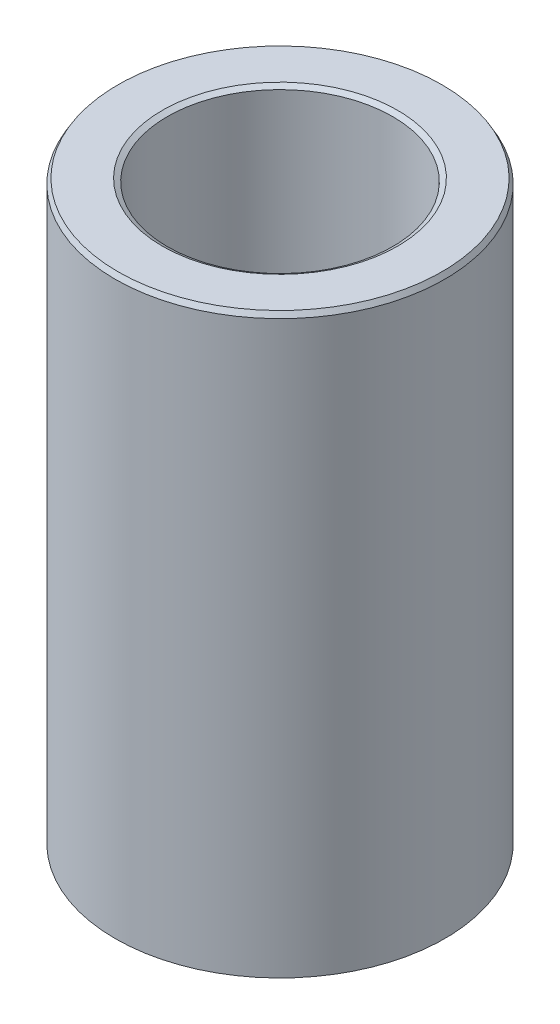
ISO-10303-21;
HEADER;
FILE_DESCRIPTION(('STEP AP214'),'2;1');
FILE_NAME('part.step','',(''),(''),'','','');
FILE_SCHEMA(('AUTOMOTIVE_DESIGN { 1 0 10303 214 1 1 1 1 }'));
ENDSEC;
DATA;
#1=APPLICATION_CONTEXT('core data for automotive mechanical design processes');
#2=APPLICATION_PROTOCOL_DEFINITION('international standard','automotive_design',2000,#1);
#3=PRODUCT_CONTEXT('',#1,'mechanical');
#4=PRODUCT('Part','Part','',(#3));
#5=PRODUCT_RELATED_PRODUCT_CATEGORY('part','',(#4));
#6=PRODUCT_DEFINITION_FORMATION('','',#4);
#7=PRODUCT_DEFINITION_CONTEXT('part definition',#1,'design');
#8=PRODUCT_DEFINITION('design','',#6,#7);
#9=PRODUCT_DEFINITION_SHAPE('','',#8);
#10=(LENGTH_UNIT() NAMED_UNIT(*) SI_UNIT(.MILLI.,.METRE.));
#11=(NAMED_UNIT(*) PLANE_ANGLE_UNIT() SI_UNIT($,.RADIAN.));
#12=(NAMED_UNIT(*) SI_UNIT($,.STERADIAN.) SOLID_ANGLE_UNIT());
#13=UNCERTAINTY_MEASURE_WITH_UNIT(LENGTH_MEASURE(1.E-05),#10,'distance_accuracy_value','');
#14=(GEOMETRIC_REPRESENTATION_CONTEXT(3) GLOBAL_UNCERTAINTY_ASSIGNED_CONTEXT((#13)) GLOBAL_UNIT_ASSIGNED_CONTEXT((#10,
#11,#12)) REPRESENTATION_CONTEXT('',''));
#15=CARTESIAN_POINT('',(0.,0.,0.));
#16=DIRECTION('',(0.,0.,1.));
#17=DIRECTION('',(1.,0.,0.));
#18=AXIS2_PLACEMENT_3D('',#15,#16,#17);
#19=CARTESIAN_POINT('',(0.,52.6650642509031,0.));
#20=DIRECTION('',(0.,-1.,0.));
#21=DIRECTION('',(0.,0.,-1.));
#22=AXIS2_PLACEMENT_3D('',#19,#20,#21);
#23=CYLINDRICAL_SURFACE('',#22,15.);
#24=CARTESIAN_POINT('',(0.,0.263552341412891,0.));
#25=DIRECTION('',(0.,1.,0.));
#26=DIRECTION('',(0.,0.,1.));
#27=AXIS2_PLACEMENT_3D('',#24,#25,#26);
#28=CIRCLE('',#27,15.);
#29=CARTESIAN_POINT('',(0.,0.263552341412891,15.));
#30=VERTEX_POINT('',#29);
#31=EDGE_CURVE('E10',#30,#30,#28,.T.);
#32=ORIENTED_EDGE('',*,*,#31,.T.);
#33=EDGE_LOOP('',(#32));
#34=FACE_BOUND('',#33,.T.);
#35=CARTESIAN_POINT('',(0.,52.2085782051222,0.));
#36=DIRECTION('',(0.,1.,0.));
#37=DIRECTION('',(0.,0.,1.));
#38=AXIS2_PLACEMENT_3D('',#35,#36,#37);
#39=CIRCLE('',#38,15.);
#40=CARTESIAN_POINT('',(0.,52.2085782051222,15.));
#41=VERTEX_POINT('',#40);
#42=EDGE_CURVE('E50',#41,#41,#39,.F.);
#43=ORIENTED_EDGE('',*,*,#42,.T.);
#44=EDGE_LOOP('',(#43));
#45=FACE_BOUND('',#44,.T.);
#46=ADVANCED_FACE('F39',(#34,#45),#23,.T.);
#47=CARTESIAN_POINT('',(0.,52.6650642509031,0.));
#48=DIRECTION('',(0.,1.,0.));
#49=DIRECTION('',(0.,0.,1.));
#50=AXIS2_PLACEMENT_3D('',#47,#48,#49);
#51=PLANE('',#50);
#52=CARTESIAN_POINT('',(0.,52.6650642509031,0.));
#53=DIRECTION('',(0.,1.,0.));
#54=DIRECTION('',(0.,0.,1.));
#55=AXIS2_PLACEMENT_3D('',#52,#53,#54);
#56=CIRCLE('',#55,10.70681682068);
#57=CARTESIAN_POINT('',(0.,52.6650642509031,10.70681682068));
#58=VERTEX_POINT('',#57);
#59=EDGE_CURVE('E58',#58,#58,#56,.F.);
#60=ORIENTED_EDGE('',*,*,#59,.T.);
#61=EDGE_LOOP('',(#60));
#62=FACE_BOUND('',#61,.T.);
#63=CARTESIAN_POINT('',(0.,52.6650642509031,0.));
#64=DIRECTION('',(0.,1.,0.));
#65=DIRECTION('',(0.,0.,1.));
#66=AXIS2_PLACEMENT_3D('',#63,#64,#65);
#67=CIRCLE('',#66,14.7364476585871);
#68=CARTESIAN_POINT('',(0.,52.6650642509031,14.7364476585871));
#69=VERTEX_POINT('',#68);
#70=EDGE_CURVE('E61',#69,#69,#67,.T.);
#71=ORIENTED_EDGE('',*,*,#70,.T.);
#72=EDGE_LOOP('',(#71));
#73=FACE_BOUND('',#72,.T.);
#74=ADVANCED_FACE('F88',(#62,#73),#51,.T.);
#75=CARTESIAN_POINT('',(0.,0.,0.));
#76=DIRECTION('',(0.,1.,0.));
#77=DIRECTION('',(0.,0.,1.));
#78=AXIS2_PLACEMENT_3D('',#75,#76,#77);
#79=PLANE('',#78);
#80=CARTESIAN_POINT('',(0.,0.,0.));
#81=DIRECTION('',(0.,1.,0.));
#82=DIRECTION('',(0.,0.,1.));
#83=AXIS2_PLACEMENT_3D('',#80,#81,#82);
#84=CIRCLE('',#83,10.513883116312);
#85=CARTESIAN_POINT('',(0.,0.,10.513883116312));
#86=VERTEX_POINT('',#85);
#87=EDGE_CURVE('E51',#86,#86,#84,.T.);
#88=ORIENTED_EDGE('',*,*,#87,.T.);
#89=EDGE_LOOP('',(#88));
#90=FACE_BOUND('',#89,.T.);
#91=CARTESIAN_POINT('',(0.,0.,0.));
#92=DIRECTION('',(0.,1.,0.));
#93=DIRECTION('',(0.,0.,1.));
#94=AXIS2_PLACEMENT_3D('',#91,#92,#93);
#95=CIRCLE('',#94,14.5435139542191);
#96=CARTESIAN_POINT('',(0.,0.,14.5435139542191));
#97=VERTEX_POINT('',#96);
#98=EDGE_CURVE('E54',#97,#97,#95,.F.);
#99=ORIENTED_EDGE('',*,*,#98,.T.);
#100=EDGE_LOOP('',(#99));
#101=FACE_BOUND('',#100,.T.);
#102=ADVANCED_FACE('F83',(#90,#101),#79,.F.);
#103=CARTESIAN_POINT('',(0.,52.6650642509031,0.));
#104=DIRECTION('',(0.,-1.,0.));
#105=DIRECTION('',(0.,0.,-1.));
#106=AXIS2_PLACEMENT_3D('',#103,#104,#105);
#107=CYLINDRICAL_SURFACE('',#106,10.2503307748991);
#108=CARTESIAN_POINT('',(0.,52.4015119094902,0.));
#109=DIRECTION('',(0.,1.,0.));
#110=DIRECTION('',(0.,0.,1.));
#111=AXIS2_PLACEMENT_3D('',#108,#109,#110);
#112=CIRCLE('',#111,10.2503307748991);
#113=CARTESIAN_POINT('',(0.,52.4015119094902,10.2503307748991));
#114=VERTEX_POINT('',#113);
#115=EDGE_CURVE('E67',#114,#114,#112,.T.);
#116=ORIENTED_EDGE('',*,*,#115,.T.);
#117=EDGE_LOOP('',(#116));
#118=FACE_BOUND('',#117,.T.);
#119=CARTESIAN_POINT('',(0.,0.456486045780871,0.));
#120=DIRECTION('',(0.,1.,0.));
#121=DIRECTION('',(0.,0.,1.));
#122=AXIS2_PLACEMENT_3D('',#119,#120,#121);
#123=CIRCLE('',#122,10.2503307748991);
#124=CARTESIAN_POINT('',(0.,0.456486045780871,10.2503307748991));
#125=VERTEX_POINT('',#124);
#126=EDGE_CURVE('E69',#125,#125,#123,.F.);
#127=ORIENTED_EDGE('',*,*,#126,.T.);
#128=EDGE_LOOP('',(#127));
#129=FACE_BOUND('',#128,.T.);
#130=ADVANCED_FACE('F71',(#118,#129),#107,.F.);
#131=CARTESIAN_POINT('',(0.,52.4015119094902,0.));
#132=DIRECTION('',(0.,1.,0.));
#133=DIRECTION('',(0.,0.,1.));
#134=AXIS2_PLACEMENT_3D('',#131,#132,#133);
#135=CONICAL_SURFACE('',#134,10.2503307748991,1.0471975511966);
#136=ORIENTED_EDGE('',*,*,#59,.F.);
#137=EDGE_LOOP('',(#136));
#138=FACE_BOUND('',#137,.T.);
#139=ORIENTED_EDGE('',*,*,#115,.F.);
#140=EDGE_LOOP('',(#139));
#141=FACE_BOUND('',#140,.T.);
#142=ADVANCED_FACE('F77',(#138,#141),#135,.F.);
#143=CARTESIAN_POINT('',(0.,0.,0.));
#144=DIRECTION('',(0.,-1.,0.));
#145=DIRECTION('',(0.,0.,-1.));
#146=AXIS2_PLACEMENT_3D('',#143,#144,#145);
#147=CONICAL_SURFACE('',#146,10.513883116312,0.523598775598286);
#148=ORIENTED_EDGE('',*,*,#126,.F.);
#149=EDGE_LOOP('',(#148));
#150=FACE_BOUND('',#149,.T.);
#151=ORIENTED_EDGE('',*,*,#87,.F.);
#152=EDGE_LOOP('',(#151));
#153=FACE_BOUND('',#152,.T.);
#154=ADVANCED_FACE('F73',(#150,#153),#147,.F.);
#155=CARTESIAN_POINT('',(0.,0.263552341412891,0.));
#156=DIRECTION('',(0.,1.,0.));
#157=DIRECTION('',(0.,0.,1.));
#158=AXIS2_PLACEMENT_3D('',#155,#156,#157);
#159=CONICAL_SURFACE('',#158,15.,1.04719755119661);
#160=ORIENTED_EDGE('',*,*,#98,.F.);
#161=EDGE_LOOP('',(#160));
#162=FACE_BOUND('',#161,.T.);
#163=ORIENTED_EDGE('',*,*,#31,.F.);
#164=EDGE_LOOP('',(#163));
#165=FACE_BOUND('',#164,.T.);
#166=ADVANCED_FACE('F76',(#162,#165),#159,.T.);
#167=CARTESIAN_POINT('',(0.,52.6650642509031,0.));
#168=DIRECTION('',(0.,-1.,0.));
#169=DIRECTION('',(0.,0.,-1.));
#170=AXIS2_PLACEMENT_3D('',#167,#168,#169);
#171=CONICAL_SURFACE('',#170,14.7364476585871,0.523598775598288);
#172=ORIENTED_EDGE('',*,*,#42,.F.);
#173=EDGE_LOOP('',(#172));
#174=FACE_BOUND('',#173,.T.);
#175=ORIENTED_EDGE('',*,*,#70,.F.);
#176=EDGE_LOOP('',(#175));
#177=FACE_BOUND('',#176,.T.);
#178=ADVANCED_FACE('F45',(#174,#177),#171,.T.);
#179=CLOSED_SHELL('',(#46,#74,#102,#130,#142,#154,#166,#178));
#180=MANIFOLD_SOLID_BREP('B2',#179);
#181=ADVANCED_BREP_SHAPE_REPRESENTATION('',(#18,#180),#14);
#182=SHAPE_DEFINITION_REPRESENTATION(#9,#181);
ENDSEC;
END-ISO-10303-21;
